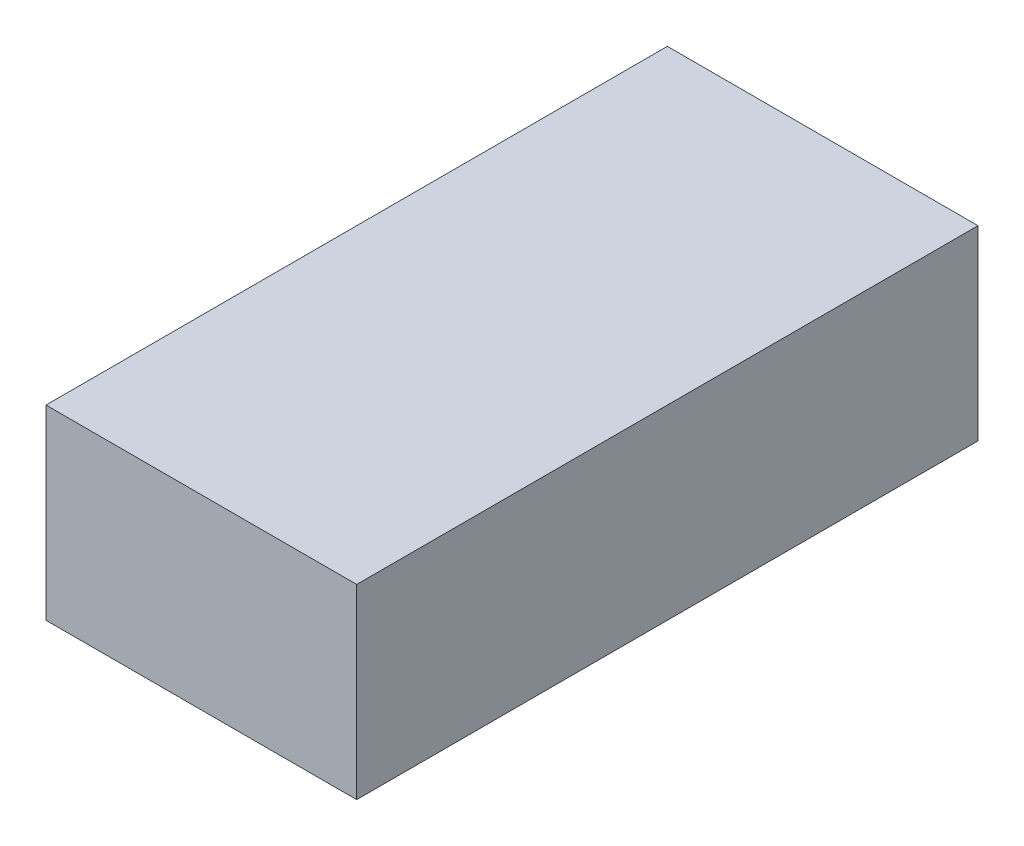
ISO-10303-21;
HEADER;
FILE_DESCRIPTION(('STEP AP214'),'2;1');
FILE_NAME('part.step','',(''),(''),'','','');
FILE_SCHEMA(('AUTOMOTIVE_DESIGN { 1 0 10303 214 1 1 1 1 }'));
ENDSEC;
DATA;
#1=APPLICATION_CONTEXT('core data for automotive mechanical design processes');
#2=APPLICATION_PROTOCOL_DEFINITION('international standard','automotive_design',2000,#1);
#3=PRODUCT_CONTEXT('',#1,'mechanical');
#4=PRODUCT('Part','Part','',(#3));
#5=PRODUCT_RELATED_PRODUCT_CATEGORY('part','',(#4));
#6=PRODUCT_DEFINITION_FORMATION('','',#4);
#7=PRODUCT_DEFINITION_CONTEXT('part definition',#1,'design');
#8=PRODUCT_DEFINITION('design','',#6,#7);
#9=PRODUCT_DEFINITION_SHAPE('','',#8);
#10=(LENGTH_UNIT() NAMED_UNIT(*) SI_UNIT(.MILLI.,.METRE.));
#11=(NAMED_UNIT(*) PLANE_ANGLE_UNIT() SI_UNIT($,.RADIAN.));
#12=(NAMED_UNIT(*) SI_UNIT($,.STERADIAN.) SOLID_ANGLE_UNIT());
#13=UNCERTAINTY_MEASURE_WITH_UNIT(LENGTH_MEASURE(1.E-05),#10,'distance_accuracy_value','');
#14=(GEOMETRIC_REPRESENTATION_CONTEXT(3) GLOBAL_UNCERTAINTY_ASSIGNED_CONTEXT((#13)) GLOBAL_UNIT_ASSIGNED_CONTEXT((#10,
#11,#12)) REPRESENTATION_CONTEXT('',''));
#15=CARTESIAN_POINT('',(0.,0.,0.));
#16=DIRECTION('',(0.,0.,1.));
#17=DIRECTION('',(1.,0.,0.));
#18=AXIS2_PLACEMENT_3D('',#15,#16,#17);
#19=CARTESIAN_POINT('',(2500.,-32.3,2272.51350251044));
#20=DIRECTION('',(0.,0.,-1.));
#21=DIRECTION('',(-1.,0.,0.));
#22=AXIS2_PLACEMENT_3D('',#19,#20,#21);
#23=PLANE('',#22);
#24=DIRECTION('',(0.,-1.,0.));
#25=VECTOR('',#24,1.);
#26=CARTESIAN_POINT('',(-2500.,-32.3,2272.51350251044));
#27=LINE('',#26,#25);
#28=CARTESIAN_POINT('',(-2500.,2967.7,2272.51350251044));
#29=VERTEX_POINT('',#28);
#30=CARTESIAN_POINT('',(-2500.,-32.3,2272.51350251044));
#31=VERTEX_POINT('',#30);
#32=EDGE_CURVE('E110',#29,#31,#27,.T.);
#33=ORIENTED_EDGE('',*,*,#32,.T.);
#34=DIRECTION('',(-1.,0.,0.));
#35=VECTOR('',#34,1.);
#36=CARTESIAN_POINT('',(2500.,-32.3,2272.51350251044));
#37=LINE('',#36,#35);
#38=CARTESIAN_POINT('',(2500.,-32.3,2272.51350251044));
#39=VERTEX_POINT('',#38);
#40=EDGE_CURVE('E12',#39,#31,#37,.T.);
#41=ORIENTED_EDGE('',*,*,#40,.F.);
#42=DIRECTION('',(0.,-1.,0.));
#43=VECTOR('',#42,1.);
#44=CARTESIAN_POINT('',(2500.,-32.3,2272.51350251044));
#45=LINE('',#44,#43);
#46=CARTESIAN_POINT('',(2500.,2967.7,2272.51350251044));
#47=VERTEX_POINT('',#46);
#48=EDGE_CURVE('E98',#47,#39,#45,.T.);
#49=ORIENTED_EDGE('',*,*,#48,.F.);
#50=DIRECTION('',(-1.,0.,0.));
#51=VECTOR('',#50,1.);
#52=CARTESIAN_POINT('',(2500.,2967.7,2272.51350251044));
#53=LINE('',#52,#51);
#54=EDGE_CURVE('E106',#47,#29,#53,.T.);
#55=ORIENTED_EDGE('',*,*,#54,.T.);
#56=EDGE_LOOP('',(#33,#41,#49,#55));
#57=FACE_BOUND('',#56,.T.);
#58=ADVANCED_FACE('F47',(#57),#23,.F.);
#59=CARTESIAN_POINT('',(2500.,-32.3,2272.51350251044));
#60=DIRECTION('',(0.,1.,0.));
#61=DIRECTION('',(0.,0.,1.));
#62=AXIS2_PLACEMENT_3D('',#59,#60,#61);
#63=PLANE('',#62);
#64=DIRECTION('',(0.,0.,-1.));
#65=VECTOR('',#64,1.);
#66=CARTESIAN_POINT('',(-2500.,-32.3,2272.51350251044));
#67=LINE('',#66,#65);
#68=CARTESIAN_POINT('',(-2500.,-32.3,-7727.48649748956));
#69=VERTEX_POINT('',#68);
#70=EDGE_CURVE('E102',#31,#69,#67,.T.);
#71=ORIENTED_EDGE('',*,*,#70,.T.);
#72=DIRECTION('',(-1.,0.,0.));
#73=VECTOR('',#72,1.);
#74=CARTESIAN_POINT('',(2500.,-32.3,-7727.48649748956));
#75=LINE('',#74,#73);
#76=CARTESIAN_POINT('',(2500.,-32.3,-7727.48649748956));
#77=VERTEX_POINT('',#76);
#78=EDGE_CURVE('E55',#77,#69,#75,.T.);
#79=ORIENTED_EDGE('',*,*,#78,.F.);
#80=DIRECTION('',(0.,0.,-1.));
#81=VECTOR('',#80,1.);
#82=CARTESIAN_POINT('',(2500.,-32.3,2272.51350251044));
#83=LINE('',#82,#81);
#84=EDGE_CURVE('E93',#39,#77,#83,.T.);
#85=ORIENTED_EDGE('',*,*,#84,.F.);
#86=ORIENTED_EDGE('',*,*,#40,.T.);
#87=EDGE_LOOP('',(#71,#79,#85,#86));
#88=FACE_BOUND('',#87,.T.);
#89=ADVANCED_FACE('F101',(#88),#63,.F.);
#90=CARTESIAN_POINT('',(2500.,-32.3,-7727.48649748956));
#91=DIRECTION('',(0.,0.,1.));
#92=DIRECTION('',(1.,0.,0.));
#93=AXIS2_PLACEMENT_3D('',#90,#91,#92);
#94=PLANE('',#93);
#95=DIRECTION('',(0.,1.,0.));
#96=VECTOR('',#95,1.);
#97=CARTESIAN_POINT('',(-2500.,-32.3,-7727.48649748956));
#98=LINE('',#97,#96);
#99=CARTESIAN_POINT('',(-2500.,2967.7,-7727.48649748956));
#100=VERTEX_POINT('',#99);
#101=EDGE_CURVE('E80',#69,#100,#98,.T.);
#102=ORIENTED_EDGE('',*,*,#101,.T.);
#103=DIRECTION('',(-1.,0.,0.));
#104=VECTOR('',#103,1.);
#105=CARTESIAN_POINT('',(2500.,2967.7,-7727.48649748956));
#106=LINE('',#105,#104);
#107=CARTESIAN_POINT('',(2500.,2967.7,-7727.48649748956));
#108=VERTEX_POINT('',#107);
#109=EDGE_CURVE('E103',#108,#100,#106,.T.);
#110=ORIENTED_EDGE('',*,*,#109,.F.);
#111=DIRECTION('',(0.,1.,0.));
#112=VECTOR('',#111,1.);
#113=CARTESIAN_POINT('',(2500.,-32.3,-7727.48649748956));
#114=LINE('',#113,#112);
#115=EDGE_CURVE('E96',#77,#108,#114,.T.);
#116=ORIENTED_EDGE('',*,*,#115,.F.);
#117=ORIENTED_EDGE('',*,*,#78,.T.);
#118=EDGE_LOOP('',(#102,#110,#116,#117));
#119=FACE_BOUND('',#118,.T.);
#120=ADVANCED_FACE('F104',(#119),#94,.F.);
#121=CARTESIAN_POINT('',(2500.,2967.7,2272.51350251044));
#122=DIRECTION('',(0.,-1.,0.));
#123=DIRECTION('',(0.,0.,-1.));
#124=AXIS2_PLACEMENT_3D('',#121,#122,#123);
#125=PLANE('',#124);
#126=DIRECTION('',(0.,0.,1.));
#127=VECTOR('',#126,1.);
#128=CARTESIAN_POINT('',(-2500.,2967.7,2272.51350251044));
#129=LINE('',#128,#127);
#130=EDGE_CURVE('E86',#100,#29,#129,.T.);
#131=ORIENTED_EDGE('',*,*,#130,.T.);
#132=ORIENTED_EDGE('',*,*,#54,.F.);
#133=DIRECTION('',(0.,0.,1.));
#134=VECTOR('',#133,1.);
#135=CARTESIAN_POINT('',(2500.,2967.7,2272.51350251044));
#136=LINE('',#135,#134);
#137=EDGE_CURVE('E63',#108,#47,#136,.T.);
#138=ORIENTED_EDGE('',*,*,#137,.F.);
#139=ORIENTED_EDGE('',*,*,#109,.T.);
#140=EDGE_LOOP('',(#131,#132,#138,#139));
#141=FACE_BOUND('',#140,.T.);
#142=ADVANCED_FACE('F117',(#141),#125,.F.);
#143=CARTESIAN_POINT('',(2500.,0.,0.));
#144=DIRECTION('',(-1.,0.,0.));
#145=DIRECTION('',(0.,0.,1.));
#146=AXIS2_PLACEMENT_3D('',#143,#144,#145);
#147=PLANE('',#146);
#148=ORIENTED_EDGE('',*,*,#48,.T.);
#149=ORIENTED_EDGE('',*,*,#84,.T.);
#150=ORIENTED_EDGE('',*,*,#115,.T.);
#151=ORIENTED_EDGE('',*,*,#137,.T.);
#152=EDGE_LOOP('',(#148,#149,#150,#151));
#153=FACE_BOUND('',#152,.T.);
#154=ADVANCED_FACE('F94',(#153),#147,.F.);
#155=CARTESIAN_POINT('',(-2500.,0.,0.));
#156=DIRECTION('',(-1.,0.,0.));
#157=DIRECTION('',(0.,0.,1.));
#158=AXIS2_PLACEMENT_3D('',#155,#156,#157);
#159=PLANE('',#158);
#160=ORIENTED_EDGE('',*,*,#32,.F.);
#161=ORIENTED_EDGE('',*,*,#130,.F.);
#162=ORIENTED_EDGE('',*,*,#101,.F.);
#163=ORIENTED_EDGE('',*,*,#70,.F.);
#164=EDGE_LOOP('',(#160,#161,#162,#163));
#165=FACE_BOUND('',#164,.T.);
#166=ADVANCED_FACE('F120',(#165),#159,.T.);
#167=CLOSED_SHELL('',(#58,#89,#120,#142,#154,#166));
#168=MANIFOLD_SOLID_BREP('B2_NOT_SHOWN',#167);
#169=CARTESIAN_POINT('',(69.,0.,0.));
#170=DIRECTION('',(0.,1.,0.));
#171=DIRECTION('',(0.,0.,1.));
#172=AXIS2_PLACEMENT_3D('',#169,#170,#171);
#173=PLANE('',#172);
#174=DIRECTION('',(-1.,0.,0.));
#175=VECTOR('',#174,1.);
#176=CARTESIAN_POINT('',(-48.6,0.,-92.6559396248703));
#177=LINE('',#176,#175);
#178=CARTESIAN_POINT('',(-48.6,0.,-92.6559396248703));
#179=VERTEX_POINT('',#178);
#180=CARTESIAN_POINT('',(-69.,0.,-92.6559396248703));
#181=VERTEX_POINT('',#180);
#182=EDGE_CURVE('E360',#179,#181,#177,.T.);
#183=ORIENTED_EDGE('',*,*,#182,.T.);
#184=DIRECTION('',(0.,0.,-1.));
#185=VECTOR('',#184,1.);
#186=CARTESIAN_POINT('',(-69.,0.,0.));
#187=LINE('',#186,#185);
#188=CARTESIAN_POINT('',(-69.,0.,-139.7));
#189=VERTEX_POINT('',#188);
#190=EDGE_CURVE('E344',#181,#189,#187,.T.);
#191=ORIENTED_EDGE('',*,*,#190,.T.);
#192=DIRECTION('',(-1.,0.,0.));
#193=VECTOR('',#192,1.);
#194=CARTESIAN_POINT('',(69.,0.,-139.7));
#195=LINE('',#194,#193);
#196=CARTESIAN_POINT('',(69.,0.,-139.7));
#197=VERTEX_POINT('',#196);
#198=EDGE_CURVE('E495',#197,#189,#195,.T.);
#199=ORIENTED_EDGE('',*,*,#198,.F.);
#200=DIRECTION('',(0.,0.,-1.));
#201=VECTOR('',#200,1.);
#202=CARTESIAN_POINT('',(69.,0.,262.79362659682));
#203=LINE('',#202,#201);
#204=CARTESIAN_POINT('',(69.,0.,-92.6559396248703));
#205=VERTEX_POINT('',#204);
#206=EDGE_CURVE('E444',#205,#197,#203,.T.);
#207=ORIENTED_EDGE('',*,*,#206,.F.);
#208=DIRECTION('',(1.,0.,0.));
#209=VECTOR('',#208,1.);
#210=CARTESIAN_POINT('',(48.6,0.,-92.6559396248703));
#211=LINE('',#210,#209);
#212=CARTESIAN_POINT('',(48.6,0.,-92.6559396248703));
#213=VERTEX_POINT('',#212);
#214=EDGE_CURVE('E397',#213,#205,#211,.T.);
#215=ORIENTED_EDGE('',*,*,#214,.F.);
#216=DIRECTION('',(0.,0.,1.));
#217=VECTOR('',#216,1.);
#218=CARTESIAN_POINT('',(48.6,0.,-28.0559396248703));
#219=LINE('',#218,#217);
#220=CARTESIAN_POINT('',(48.6,0.,-28.0559396248703));
#221=VERTEX_POINT('',#220);
#222=EDGE_CURVE('E394',#213,#221,#219,.T.);
#223=ORIENTED_EDGE('',*,*,#222,.T.);
#224=DIRECTION('',(1.,0.,0.));
#225=VECTOR('',#224,1.);
#226=CARTESIAN_POINT('',(48.6,0.,-28.0559396248703));
#227=LINE('',#226,#225);
#228=CARTESIAN_POINT('',(69.,0.,-28.0559396248703));
#229=VERTEX_POINT('',#228);
#230=EDGE_CURVE('E399',#221,#229,#227,.T.);
#231=ORIENTED_EDGE('',*,*,#230,.T.);
#232=CARTESIAN_POINT('',(69.,0.,160.34406037513));
#233=VERTEX_POINT('',#232);
#234=EDGE_CURVE('E450',#233,#229,#203,.T.);
#235=ORIENTED_EDGE('',*,*,#234,.F.);
#236=DIRECTION('',(1.,0.,0.));
#237=VECTOR('',#236,1.);
#238=CARTESIAN_POINT('',(48.6,0.,160.34406037513));
#239=LINE('',#238,#237);
#240=CARTESIAN_POINT('',(48.6,0.,160.34406037513));
#241=VERTEX_POINT('',#240);
#242=EDGE_CURVE('E410',#241,#233,#239,.T.);
#243=ORIENTED_EDGE('',*,*,#242,.F.);
#244=DIRECTION('',(0.,0.,1.));
#245=VECTOR('',#244,1.);
#246=CARTESIAN_POINT('',(48.6,0.,224.94406037513));
#247=LINE('',#246,#245);
#248=CARTESIAN_POINT('',(48.6,0.,224.94406037513));
#249=VERTEX_POINT('',#248);
#250=EDGE_CURVE('E407',#241,#249,#247,.T.);
#251=ORIENTED_EDGE('',*,*,#250,.T.);
#252=DIRECTION('',(1.,0.,0.));
#253=VECTOR('',#252,1.);
#254=CARTESIAN_POINT('',(48.6,0.,224.94406037513));
#255=LINE('',#254,#253);
#256=CARTESIAN_POINT('',(69.,0.,224.94406037513));
#257=VERTEX_POINT('',#256);
#258=EDGE_CURVE('E412',#249,#257,#255,.T.);
#259=ORIENTED_EDGE('',*,*,#258,.T.);
#260=CARTESIAN_POINT('',(69.,0.,262.79362659682));
#261=VERTEX_POINT('',#260);
#262=EDGE_CURVE('E446',#261,#257,#203,.T.);
#263=ORIENTED_EDGE('',*,*,#262,.F.);
#264=DIRECTION('',(-1.,0.,0.));
#265=VECTOR('',#264,1.);
#266=CARTESIAN_POINT('',(69.,0.,262.79362659682));
#267=LINE('',#266,#265);
#268=CARTESIAN_POINT('',(-69.,0.,262.79362659682));
#269=VERTEX_POINT('',#268);
#270=EDGE_CURVE('E497',#261,#269,#267,.T.);
#271=ORIENTED_EDGE('',*,*,#270,.T.);
#272=CARTESIAN_POINT('',(-69.,0.,224.94406037513));
#273=VERTEX_POINT('',#272);
#274=EDGE_CURVE('E358',#269,#273,#187,.T.);
#275=ORIENTED_EDGE('',*,*,#274,.T.);
#276=DIRECTION('',(-1.,0.,0.));
#277=VECTOR('',#276,1.);
#278=CARTESIAN_POINT('',(-48.6,0.,224.94406037513));
#279=LINE('',#278,#277);
#280=CARTESIAN_POINT('',(-48.6,0.,224.94406037513));
#281=VERTEX_POINT('',#280);
#282=EDGE_CURVE('E383',#281,#273,#279,.T.);
#283=ORIENTED_EDGE('',*,*,#282,.F.);
#284=DIRECTION('',(0.,0.,1.));
#285=VECTOR('',#284,1.);
#286=CARTESIAN_POINT('',(-48.6,0.,224.94406037513));
#287=LINE('',#286,#285);
#288=CARTESIAN_POINT('',(-48.6,0.,160.34406037513));
#289=VERTEX_POINT('',#288);
#290=EDGE_CURVE('E380',#289,#281,#287,.T.);
#291=ORIENTED_EDGE('',*,*,#290,.F.);
#292=DIRECTION('',(-1.,0.,0.));
#293=VECTOR('',#292,1.);
#294=CARTESIAN_POINT('',(-48.6,0.,160.34406037513));
#295=LINE('',#294,#293);
#296=CARTESIAN_POINT('',(-69.,0.,160.34406037513));
#297=VERTEX_POINT('',#296);
#298=EDGE_CURVE('E386',#289,#297,#295,.T.);
#299=ORIENTED_EDGE('',*,*,#298,.T.);
#300=CARTESIAN_POINT('',(-69.,0.,-28.0559396248702));
#301=VERTEX_POINT('',#300);
#302=EDGE_CURVE('E355',#297,#301,#187,.T.);
#303=ORIENTED_EDGE('',*,*,#302,.T.);
#304=DIRECTION('',(-1.,0.,0.));
#305=VECTOR('',#304,1.);
#306=CARTESIAN_POINT('',(-48.6,0.,-28.0559396248703));
#307=LINE('',#306,#305);
#308=CARTESIAN_POINT('',(-48.6,0.,-28.0559396248703));
#309=VERTEX_POINT('',#308);
#310=EDGE_CURVE('E367',#309,#301,#307,.T.);
#311=ORIENTED_EDGE('',*,*,#310,.F.);
#312=DIRECTION('',(0.,0.,1.));
#313=VECTOR('',#312,1.);
#314=CARTESIAN_POINT('',(-48.6,0.,-28.0559396248703));
#315=LINE('',#314,#313);
#316=EDGE_CURVE('E362',#179,#309,#315,.T.);
#317=ORIENTED_EDGE('',*,*,#316,.F.);
#318=EDGE_LOOP('',(#183,#191,#199,#207,#215,#223,#231,#235,#243,#251,#259,#263,#271,#275,#283,
#291,#299,#303,#311,#317));
#319=FACE_BOUND('',#318,.T.);
#320=ADVANCED_FACE('F171',(#319),#173,.F.);
#321=CARTESIAN_POINT('',(69.,81.9,-124.7));
#322=DIRECTION('',(0.,0.,-1.));
#323=DIRECTION('',(0.,1.,0.));
#324=AXIS2_PLACEMENT_3D('',#321,#322,#323);
#325=PLANE('',#324);
#326=DIRECTION('',(-1.,0.,0.));
#327=VECTOR('',#326,1.);
#328=CARTESIAN_POINT('',(69.,81.9,-124.7));
#329=LINE('',#328,#327);
#330=CARTESIAN_POINT('',(54.,81.9,-124.7));
#331=VERTEX_POINT('',#330);
#332=CARTESIAN_POINT('',(-54.,81.9,-124.7));
#333=VERTEX_POINT('',#332);
#334=EDGE_CURVE('E490',#331,#333,#329,.T.);
#335=ORIENTED_EDGE('',*,*,#334,.T.);
#336=DIRECTION('',(0.,-1.,0.));
#337=VECTOR('',#336,1.);
#338=CARTESIAN_POINT('',(-54.,207.498925154637,-124.7));
#339=LINE('',#338,#337);
#340=CARTESIAN_POINT('',(-54.,20.,-124.7));
#341=VERTEX_POINT('',#340);
#342=EDGE_CURVE('E427',#333,#341,#339,.T.);
#343=ORIENTED_EDGE('',*,*,#342,.T.);
#344=DIRECTION('',(-1.,0.,0.));
#345=VECTOR('',#344,1.);
#346=CARTESIAN_POINT('',(69.,20.,-124.7));
#347=LINE('',#346,#345);
#348=CARTESIAN_POINT('',(54.,20.,-124.7));
#349=VERTEX_POINT('',#348);
#350=EDGE_CURVE('E487',#349,#341,#347,.T.);
#351=ORIENTED_EDGE('',*,*,#350,.F.);
#352=DIRECTION('',(0.,-1.,0.));
#353=VECTOR('',#352,1.);
#354=CARTESIAN_POINT('',(54.,207.498925154637,-124.7));
#355=LINE('',#354,#353);
#356=EDGE_CURVE('E438',#331,#349,#355,.T.);
#357=ORIENTED_EDGE('',*,*,#356,.F.);
#358=EDGE_LOOP('',(#335,#343,#351,#357));
#359=FACE_BOUND('',#358,.T.);
#360=ADVANCED_FACE('F612',(#359),#325,.F.);
#361=CARTESIAN_POINT('',(69.,20.,-124.7));
#362=DIRECTION('',(0.,-1.,0.));
#363=DIRECTION('',(0.,0.,-1.));
#364=AXIS2_PLACEMENT_3D('',#361,#362,#363);
#365=PLANE('',#364);
#366=ORIENTED_EDGE('',*,*,#350,.T.);
#367=DIRECTION('',(0.,0.,1.));
#368=VECTOR('',#367,1.);
#369=CARTESIAN_POINT('',(-54.,20.,0.));
#370=LINE('',#369,#368);
#371=CARTESIAN_POINT('',(-54.,20.,0.));
#372=VERTEX_POINT('',#371);
#373=EDGE_CURVE('E415',#341,#372,#370,.T.);
#374=ORIENTED_EDGE('',*,*,#373,.T.);
#375=DIRECTION('',(-1.,0.,0.));
#376=VECTOR('',#375,1.);
#377=CARTESIAN_POINT('',(69.,20.,0.));
#378=LINE('',#377,#376);
#379=CARTESIAN_POINT('',(54.,20.,0.));
#380=VERTEX_POINT('',#379);
#381=EDGE_CURVE('E467',#380,#372,#378,.T.);
#382=ORIENTED_EDGE('',*,*,#381,.F.);
#383=DIRECTION('',(0.,0.,1.));
#384=VECTOR('',#383,1.);
#385=CARTESIAN_POINT('',(54.,20.,0.));
#386=LINE('',#385,#384);
#387=EDGE_CURVE('E425',#349,#380,#386,.T.);
#388=ORIENTED_EDGE('',*,*,#387,.F.);
#389=EDGE_LOOP('',(#366,#374,#382,#388));
#390=FACE_BOUND('',#389,.T.);
#391=ADVANCED_FACE('F617',(#390),#365,.F.);
#392=CARTESIAN_POINT('',(69.,20.,0.));
#393=DIRECTION('',(0.,0.,1.));
#394=DIRECTION('',(1.,0.,0.));
#395=AXIS2_PLACEMENT_3D('',#392,#393,#394);
#396=PLANE('',#395);
#397=DIRECTION('',(0.,1.,0.));
#398=VECTOR('',#397,1.);
#399=CARTESIAN_POINT('',(-69.,20.,0.));
#400=LINE('',#399,#398);
#401=CARTESIAN_POINT('',(-69.,81.9000000000001,0.));
#402=VERTEX_POINT('',#401);
#403=CARTESIAN_POINT('',(-69.,123.7,0.));
#404=VERTEX_POINT('',#403);
#405=EDGE_CURVE('E472',#402,#404,#400,.T.);
#406=ORIENTED_EDGE('',*,*,#405,.T.);
#407=DIRECTION('',(-1.,0.,0.));
#408=VECTOR('',#407,1.);
#409=CARTESIAN_POINT('',(69.,123.7,0.));
#410=LINE('',#409,#408);
#411=CARTESIAN_POINT('',(69.,123.7,0.));
#412=VERTEX_POINT('',#411);
#413=EDGE_CURVE('E519',#404,#412,#410,.F.);
#414=ORIENTED_EDGE('',*,*,#413,.T.);
#415=DIRECTION('',(0.,1.,0.));
#416=VECTOR('',#415,1.);
#417=CARTESIAN_POINT('',(69.,20.,0.));
#418=LINE('',#417,#416);
#419=CARTESIAN_POINT('',(69.,81.9000000000001,0.));
#420=VERTEX_POINT('',#419);
#421=EDGE_CURVE('E454',#420,#412,#418,.T.);
#422=ORIENTED_EDGE('',*,*,#421,.F.);
#423=DIRECTION('',(-1.,0.,0.));
#424=VECTOR('',#423,1.);
#425=CARTESIAN_POINT('',(69.,81.9000000000001,0.));
#426=LINE('',#425,#424);
#427=CARTESIAN_POINT('',(54.,81.9000000000001,0.));
#428=VERTEX_POINT('',#427);
#429=EDGE_CURVE('E433',#420,#428,#426,.T.);
#430=ORIENTED_EDGE('',*,*,#429,.T.);
#431=DIRECTION('',(0.,-1.,0.));
#432=VECTOR('',#431,1.);
#433=CARTESIAN_POINT('',(54.,207.498925154637,0.));
#434=LINE('',#433,#432);
#435=EDGE_CURVE('E435',#428,#380,#434,.T.);
#436=ORIENTED_EDGE('',*,*,#435,.T.);
#437=ORIENTED_EDGE('',*,*,#381,.T.);
#438=DIRECTION('',(0.,-1.,0.));
#439=VECTOR('',#438,1.);
#440=CARTESIAN_POINT('',(-54.,207.498925154637,0.));
#441=LINE('',#440,#439);
#442=CARTESIAN_POINT('',(-54.,81.9000000000001,0.));
#443=VERTEX_POINT('',#442);
#444=EDGE_CURVE('E422',#443,#372,#441,.T.);
#445=ORIENTED_EDGE('',*,*,#444,.F.);
#446=DIRECTION('',(1.,0.,0.));
#447=VECTOR('',#446,1.);
#448=CARTESIAN_POINT('',(-69.,81.9000000000001,0.));
#449=LINE('',#448,#447);
#450=EDGE_CURVE('E421',#402,#443,#449,.T.);
#451=ORIENTED_EDGE('',*,*,#450,.F.);
#452=EDGE_LOOP('',(#406,#414,#422,#430,#436,#437,#445,#451));
#453=FACE_BOUND('',#452,.T.);
#454=ADVANCED_FACE('F625',(#453),#396,.F.);
#455=CARTESIAN_POINT('',(69.,15.7395723137565,255.14406037513));
#456=DIRECTION('',(-1.,0.,0.));
#457=DIRECTION('',(0.,0.,1.));
#458=AXIS2_PLACEMENT_3D('',#455,#456,#457);
#459=CYLINDRICAL_SURFACE('',#458,17.5);
#460=CARTESIAN_POINT('',(69.,15.7395723137565,255.14406037513));
#461=DIRECTION('',(1.,0.,0.));
#462=DIRECTION('',(0.,0.,-1.));
#463=AXIS2_PLACEMENT_3D('',#460,#461,#462);
#464=CIRCLE('',#463,17.5);
#465=CARTESIAN_POINT('',(69.,29.1597981364929,266.375602516206));
#466=VERTEX_POINT('',#465);
#467=EDGE_CURVE('E442',#466,#261,#464,.T.);
#468=ORIENTED_EDGE('',*,*,#467,.F.);
#469=DIRECTION('',(-1.,0.,0.));
#470=VECTOR('',#469,1.);
#471=CARTESIAN_POINT('',(69.,29.1597981364929,266.375602516206));
#472=LINE('',#471,#470);
#473=CARTESIAN_POINT('',(-69.,29.1597981364929,266.375602516206));
#474=VERTEX_POINT('',#473);
#475=EDGE_CURVE('E500',#466,#474,#472,.T.);
#476=ORIENTED_EDGE('',*,*,#475,.T.);
#477=CARTESIAN_POINT('',(-69.,15.7395723137565,255.14406037513));
#478=DIRECTION('',(1.,0.,0.));
#479=DIRECTION('',(0.,0.,-1.));
#480=AXIS2_PLACEMENT_3D('',#477,#478,#479);
#481=CIRCLE('',#480,17.5);
#482=EDGE_CURVE('E356',#474,#269,#481,.T.);
#483=ORIENTED_EDGE('',*,*,#482,.T.);
#484=ORIENTED_EDGE('',*,*,#270,.F.);
#485=EDGE_LOOP('',(#468,#476,#483,#484));
#486=FACE_BOUND('',#485,.T.);
#487=ADVANCED_FACE('F567',(#486),#459,.T.);
#488=CARTESIAN_POINT('',(69.,0.,-139.7));
#489=DIRECTION('',(0.,0.,1.));
#490=DIRECTION('',(1.,0.,0.));
#491=AXIS2_PLACEMENT_3D('',#488,#489,#490);
#492=PLANE('',#491);
#493=DIRECTION('',(0.,1.,0.));
#494=VECTOR('',#493,1.);
#495=CARTESIAN_POINT('',(-69.,0.,-139.7));
#496=LINE('',#495,#494);
#497=CARTESIAN_POINT('',(-69.,81.9,-139.7));
#498=VERTEX_POINT('',#497);
#499=EDGE_CURVE('E351',#189,#498,#496,.T.);
#500=ORIENTED_EDGE('',*,*,#499,.T.);
#501=DIRECTION('',(-1.,0.,0.));
#502=VECTOR('',#501,1.);
#503=CARTESIAN_POINT('',(69.,81.9,-139.7));
#504=LINE('',#503,#502);
#505=CARTESIAN_POINT('',(69.,81.9,-139.7));
#506=VERTEX_POINT('',#505);
#507=EDGE_CURVE('E492',#506,#498,#504,.T.);
#508=ORIENTED_EDGE('',*,*,#507,.F.);
#509=DIRECTION('',(0.,1.,0.));
#510=VECTOR('',#509,1.);
#511=CARTESIAN_POINT('',(69.,0.,-139.7));
#512=LINE('',#511,#510);
#513=EDGE_CURVE('E449',#197,#506,#512,.T.);
#514=ORIENTED_EDGE('',*,*,#513,.F.);
#515=ORIENTED_EDGE('',*,*,#198,.T.);
#516=EDGE_LOOP('',(#500,#508,#514,#515));
#517=FACE_BOUND('',#516,.T.);
#518=ADVANCED_FACE('F584',(#517),#492,.F.);
#519=CARTESIAN_POINT('',(69.,81.9,-139.7));
#520=DIRECTION('',(0.,-1.,0.));
#521=DIRECTION('',(0.,0.,-1.));
#522=AXIS2_PLACEMENT_3D('',#519,#520,#521);
#523=PLANE('',#522);
#524=DIRECTION('',(0.,0.,1.));
#525=VECTOR('',#524,1.);
#526=CARTESIAN_POINT('',(-69.,81.9,-139.7));
#527=LINE('',#526,#525);
#528=EDGE_CURVE('E470',#498,#402,#527,.T.);
#529=ORIENTED_EDGE('',*,*,#528,.T.);
#530=ORIENTED_EDGE('',*,*,#450,.T.);
#531=DIRECTION('',(0.,0.,-1.));
#532=VECTOR('',#531,1.);
#533=CARTESIAN_POINT('',(-54.,81.9000000000001,1.40315921572861E-13));
#534=LINE('',#533,#532);
#535=EDGE_CURVE('E418',#443,#333,#534,.T.);
#536=ORIENTED_EDGE('',*,*,#535,.T.);
#537=ORIENTED_EDGE('',*,*,#334,.F.);
#538=DIRECTION('',(0.,0.,-1.));
#539=VECTOR('',#538,1.);
#540=CARTESIAN_POINT('',(54.,81.9000000000001,1.40315921572861E-13));
#541=LINE('',#540,#539);
#542=EDGE_CURVE('E431',#428,#331,#541,.T.);
#543=ORIENTED_EDGE('',*,*,#542,.F.);
#544=ORIENTED_EDGE('',*,*,#429,.F.);
#545=DIRECTION('',(0.,0.,1.));
#546=VECTOR('',#545,1.);
#547=CARTESIAN_POINT('',(69.,81.9,-139.7));
#548=LINE('',#547,#546);
#549=EDGE_CURVE('E452',#506,#420,#548,.T.);
#550=ORIENTED_EDGE('',*,*,#549,.F.);
#551=ORIENTED_EDGE('',*,*,#507,.T.);
#552=EDGE_LOOP('',(#529,#530,#536,#537,#543,#544,#550,#551));
#553=FACE_BOUND('',#552,.T.);
#554=ADVANCED_FACE('F588',(#553),#523,.F.);
#555=CARTESIAN_POINT('',(69.,133.7,0.));
#556=DIRECTION('',(0.,-1.,0.));
#557=DIRECTION('',(0.,0.,-1.));
#558=AXIS2_PLACEMENT_3D('',#555,#556,#557);
#559=PLANE('',#558);
#560=DIRECTION('',(0.,0.,1.));
#561=VECTOR('',#560,1.);
#562=CARTESIAN_POINT('',(69.,133.7,0.));
#563=LINE('',#562,#561);
#564=CARTESIAN_POINT('',(69.,133.7,10.));
#565=VERTEX_POINT('',#564);
#566=CARTESIAN_POINT('',(69.,133.7,111.84701211121));
#567=VERTEX_POINT('',#566);
#568=EDGE_CURVE('E457',#565,#567,#563,.T.);
#569=ORIENTED_EDGE('',*,*,#568,.F.);
#570=DIRECTION('',(-1.,0.,0.));
#571=VECTOR('',#570,1.);
#572=CARTESIAN_POINT('',(69.,133.7,10.));
#573=LINE('',#572,#571);
#574=CARTESIAN_POINT('',(-69.,133.7,10.));
#575=VERTEX_POINT('',#574);
#576=EDGE_CURVE('E510',#565,#575,#573,.T.);
#577=ORIENTED_EDGE('',*,*,#576,.T.);
#578=DIRECTION('',(0.,0.,1.));
#579=VECTOR('',#578,1.);
#580=CARTESIAN_POINT('',(-69.,133.7,0.));
#581=LINE('',#580,#579);
#582=CARTESIAN_POINT('',(-69.,133.7,111.84701211121));
#583=VERTEX_POINT('',#582);
#584=EDGE_CURVE('E475',#575,#583,#581,.T.);
#585=ORIENTED_EDGE('',*,*,#584,.T.);
#586=DIRECTION('',(-1.,0.,0.));
#587=VECTOR('',#586,1.);
#588=CARTESIAN_POINT('',(69.,133.7,111.84701211121));
#589=LINE('',#588,#587);
#590=EDGE_CURVE('E508',#583,#567,#589,.F.);
#591=ORIENTED_EDGE('',*,*,#590,.T.);
#592=EDGE_LOOP('',(#569,#577,#585,#591));
#593=FACE_BOUND('',#592,.T.);
#594=ADVANCED_FACE('F598',(#593),#559,.F.);
#595=CARTESIAN_POINT('',(69.,133.7,115.));
#596=DIRECTION('',(0.,-0.819152044288995,-0.573576436351042));
#597=DIRECTION('',(0.,0.573576436351042,-0.819152044288995));
#598=AXIS2_PLACEMENT_3D('',#595,#596,#597);
#599=PLANE('',#598);
#600=DIRECTION('',(0.,-0.573576436351042,0.819152044288994));
#601=VECTOR('',#600,1.);
#602=CARTESIAN_POINT('',(69.,133.7,115.));
#603=LINE('',#602,#601);
#604=CARTESIAN_POINT('',(69.,131.89152044289,117.582776474721));
#605=VERTEX_POINT('',#604);
#606=CARTESIAN_POINT('',(69.,95.7296916570861,169.227220175317));
#607=VERTEX_POINT('',#606);
#608=EDGE_CURVE('E460',#605,#607,#603,.T.);
#609=ORIENTED_EDGE('',*,*,#608,.F.);
#610=DIRECTION('',(-1.,0.,0.));
#611=VECTOR('',#610,1.);
#612=CARTESIAN_POINT('',(69.,131.89152044289,117.582776474721));
#613=LINE('',#612,#611);
#614=CARTESIAN_POINT('',(-69.,131.89152044289,117.582776474721));
#615=VERTEX_POINT('',#614);
#616=EDGE_CURVE('E529',#605,#615,#613,.T.);
#617=ORIENTED_EDGE('',*,*,#616,.T.);
#618=DIRECTION('',(0.,-0.573576436351042,0.819152044288994));
#619=VECTOR('',#618,1.);
#620=CARTESIAN_POINT('',(-69.,133.7,115.));
#621=LINE('',#620,#619);
#622=CARTESIAN_POINT('',(-69.,95.7296916570861,169.227220175317));
#623=VERTEX_POINT('',#622);
#624=EDGE_CURVE('E478',#615,#623,#621,.T.);
#625=ORIENTED_EDGE('',*,*,#624,.T.);
#626=DIRECTION('',(-1.,0.,0.));
#627=VECTOR('',#626,1.);
#628=CARTESIAN_POINT('',(69.,95.7296916570861,169.227220175317));
#629=LINE('',#628,#627);
#630=EDGE_CURVE('E527',#623,#607,#629,.F.);
#631=ORIENTED_EDGE('',*,*,#630,.T.);
#632=EDGE_LOOP('',(#609,#617,#625,#631));
#633=FACE_BOUND('',#632,.T.);
#634=ADVANCED_FACE('F546',(#633),#599,.F.);
#635=CARTESIAN_POINT('',(69.,94.3526564663185,171.193830238225));
#636=DIRECTION('',(0.,-0.990268068741571,-0.139173100960059));
#637=DIRECTION('',(0.,0.139173100960059,-0.990268068741571));
#638=AXIS2_PLACEMENT_3D('',#635,#636,#637);
#639=PLANE('',#638);
#640=DIRECTION('',(0.,-0.139173100960059,0.990268068741571));
#641=VECTOR('',#640,1.);
#642=CARTESIAN_POINT('',(69.,94.3526564663185,171.193830238225));
#643=LINE('',#642,#641);
#644=CARTESIAN_POINT('',(69.,94.0185314125603,173.571253529226));
#645=VERTEX_POINT('',#644);
#646=CARTESIAN_POINT('',(69.,82.6889579367665,254.185357606421));
#647=VERTEX_POINT('',#646);
#648=EDGE_CURVE('E462',#645,#647,#643,.T.);
#649=ORIENTED_EDGE('',*,*,#648,.F.);
#650=DIRECTION('',(-1.,0.,0.));
#651=VECTOR('',#650,1.);
#652=CARTESIAN_POINT('',(-69.,94.0185314125603,173.571253529226));
#653=LINE('',#652,#651);
#654=CARTESIAN_POINT('',(-69.,94.0185314125603,173.571253529226));
#655=VERTEX_POINT('',#654);
#656=EDGE_CURVE('E533',#645,#655,#653,.T.);
#657=ORIENTED_EDGE('',*,*,#656,.T.);
#658=DIRECTION('',(0.,-0.139173100960059,0.990268068741571));
#659=VECTOR('',#658,1.);
#660=CARTESIAN_POINT('',(-69.,94.3526564663185,171.193830238225));
#661=LINE('',#660,#659);
#662=CARTESIAN_POINT('',(-69.,82.6889579367665,254.185357606421));
#663=VERTEX_POINT('',#662);
#664=EDGE_CURVE('E481',#655,#663,#661,.T.);
#665=ORIENTED_EDGE('',*,*,#664,.T.);
#666=DIRECTION('',(-1.,0.,0.));
#667=VECTOR('',#666,1.);
#668=CARTESIAN_POINT('',(69.,82.6889579367665,254.185357606421));
#669=LINE('',#668,#667);
#670=EDGE_CURVE('E186',#663,#647,#669,.F.);
#671=ORIENTED_EDGE('',*,*,#670,.T.);
#672=EDGE_LOOP('',(#649,#657,#665,#671));
#673=FACE_BOUND('',#672,.T.);
#674=ADVANCED_FACE('F549',(#673),#639,.F.);
#675=CARTESIAN_POINT('',(69.,81.4791446275131,262.79362659682));
#676=DIRECTION('',(0.,0.,-1.));
#677=DIRECTION('',(0.,1.,0.));
#678=AXIS2_PLACEMENT_3D('',#675,#676,#677);
#679=PLANE('',#678);
#680=DIRECTION('',(0.,-1.,0.));
#681=VECTOR('',#680,1.);
#682=CARTESIAN_POINT('',(-69.,81.4791446275131,262.79362659682));
#683=LINE('',#682,#681);
#684=CARTESIAN_POINT('',(-69.,72.7862772493507,262.79362659682));
#685=VERTEX_POINT('',#684);
#686=CARTESIAN_POINT('',(-69.,36.8284986066279,262.79362659682));
#687=VERTEX_POINT('',#686);
#688=EDGE_CURVE('E445',#685,#687,#683,.T.);
#689=ORIENTED_EDGE('',*,*,#688,.T.);
#690=DIRECTION('',(1.,0.,0.));
#691=VECTOR('',#690,1.);
#692=CARTESIAN_POINT('',(69.,36.8284986066279,262.79362659682));
#693=LINE('',#692,#691);
#694=CARTESIAN_POINT('',(69.,36.8284986066279,262.79362659682));
#695=VERTEX_POINT('',#694);
#696=EDGE_CURVE('E506',#687,#695,#693,.T.);
#697=ORIENTED_EDGE('',*,*,#696,.T.);
#698=DIRECTION('',(0.,-1.,0.));
#699=VECTOR('',#698,1.);
#700=CARTESIAN_POINT('',(69.,81.4791446275131,262.79362659682));
#701=LINE('',#700,#699);
#702=CARTESIAN_POINT('',(69.,72.7862772493507,262.79362659682));
#703=VERTEX_POINT('',#702);
#704=EDGE_CURVE('E464',#703,#695,#701,.T.);
#705=ORIENTED_EDGE('',*,*,#704,.F.);
#706=DIRECTION('',(-1.,0.,0.));
#707=VECTOR('',#706,1.);
#708=CARTESIAN_POINT('',(69.,72.7862772493507,262.79362659682));
#709=LINE('',#708,#707);
#710=EDGE_CURVE('E503',#703,#685,#709,.T.);
#711=ORIENTED_EDGE('',*,*,#710,.T.);
#712=EDGE_LOOP('',(#689,#697,#705,#711));
#713=FACE_BOUND('',#712,.T.);
#714=ADVANCED_FACE('F557',(#713),#679,.F.);
#715=CARTESIAN_POINT('',(69.,15.7395723137565,255.14406037513));
#716=DIRECTION('',(1.,0.,0.));
#717=DIRECTION('',(0.,0.,-1.));
#718=AXIS2_PLACEMENT_3D('',#715,#716,#717);
#719=PLANE('',#718);
#720=ORIENTED_EDGE('',*,*,#421,.T.);
#721=CARTESIAN_POINT('',(69.,123.7,10.));
#722=DIRECTION('',(1.,0.,0.));
#723=DIRECTION('',(0.,0.,-1.));
#724=AXIS2_PLACEMENT_3D('',#721,#722,#723);
#725=CIRCLE('',#724,10.);
#726=EDGE_CURVE('E525',#412,#565,#725,.T.);
#727=ORIENTED_EDGE('',*,*,#726,.T.);
#728=ORIENTED_EDGE('',*,*,#568,.T.);
#729=CARTESIAN_POINT('',(69.,123.7,111.84701211121));
#730=DIRECTION('',(1.,0.,0.));
#731=DIRECTION('',(0.,0.,-1.));
#732=AXIS2_PLACEMENT_3D('',#729,#730,#731);
#733=CIRCLE('',#732,10.);
#734=EDGE_CURVE('E523',#567,#605,#733,.T.);
#735=ORIENTED_EDGE('',*,*,#734,.T.);
#736=ORIENTED_EDGE('',*,*,#608,.T.);
#737=CARTESIAN_POINT('',(69.,103.921212099976,174.962984538827));
#738=DIRECTION('',(1.,0.,0.));
#739=DIRECTION('',(0.,0.,-1.));
#740=AXIS2_PLACEMENT_3D('',#737,#738,#739);
#741=CIRCLE('',#740,10.);
#742=EDGE_CURVE('E45',#607,#645,#741,.F.);
#743=ORIENTED_EDGE('',*,*,#742,.T.);
#744=ORIENTED_EDGE('',*,*,#648,.T.);
#745=CARTESIAN_POINT('',(69.,72.7862772493507,252.79362659682));
#746=DIRECTION('',(1.,0.,0.));
#747=DIRECTION('',(0.,0.,-1.));
#748=AXIS2_PLACEMENT_3D('',#745,#746,#747);
#749=CIRCLE('',#748,10.);
#750=EDGE_CURVE('E521',#647,#703,#749,.T.);
#751=ORIENTED_EDGE('',*,*,#750,.T.);
#752=ORIENTED_EDGE('',*,*,#704,.T.);
#753=CARTESIAN_POINT('',(69.,36.8284986066279,272.79362659682));
#754=DIRECTION('',(1.,0.,0.));
#755=DIRECTION('',(0.,0.,-1.));
#756=AXIS2_PLACEMENT_3D('',#753,#754,#755);
#757=CIRCLE('',#756,10.);
#758=EDGE_CURVE('E538',#695,#466,#757,.F.);
#759=ORIENTED_EDGE('',*,*,#758,.T.);
#760=ORIENTED_EDGE('',*,*,#467,.T.);
#761=ORIENTED_EDGE('',*,*,#262,.T.);
#762=CARTESIAN_POINT('',(69.,0.,192.64406037513));
#763=DIRECTION('',(1.,0.,0.));
#764=DIRECTION('',(0.,0.,-1.));
#765=AXIS2_PLACEMENT_3D('',#762,#763,#764);
#766=CIRCLE('',#765,32.3);
#767=EDGE_CURVE('E402',#257,#233,#766,.T.);
#768=ORIENTED_EDGE('',*,*,#767,.T.);
#769=ORIENTED_EDGE('',*,*,#234,.T.);
#770=CARTESIAN_POINT('',(69.,0.,-60.3559396248703));
#771=DIRECTION('',(1.,0.,0.));
#772=DIRECTION('',(0.,0.,-1.));
#773=AXIS2_PLACEMENT_3D('',#770,#771,#772);
#774=CIRCLE('',#773,32.3);
#775=EDGE_CURVE('E389',#229,#205,#774,.T.);
#776=ORIENTED_EDGE('',*,*,#775,.T.);
#777=ORIENTED_EDGE('',*,*,#206,.T.);
#778=ORIENTED_EDGE('',*,*,#513,.T.);
#779=ORIENTED_EDGE('',*,*,#549,.T.);
#780=EDGE_LOOP('',(#720,#727,#728,#735,#736,#743,#744,#751,#752,#759,#760,#761,#768,#769,#776,
#777,#778,#779));
#781=FACE_BOUND('',#780,.T.);
#782=ADVANCED_FACE('F551',(#781),#719,.T.);
#783=CARTESIAN_POINT('',(-69.,15.7395723137565,255.14406037513));
#784=DIRECTION('',(1.,0.,0.));
#785=DIRECTION('',(0.,0.,-1.));
#786=AXIS2_PLACEMENT_3D('',#783,#784,#785);
#787=PLANE('',#786);
#788=ORIENTED_EDGE('',*,*,#584,.F.);
#789=CARTESIAN_POINT('',(-69.,123.7,10.));
#790=DIRECTION('',(1.,0.,0.));
#791=DIRECTION('',(0.,0.,-1.));
#792=AXIS2_PLACEMENT_3D('',#789,#790,#791);
#793=CIRCLE('',#792,10.);
#794=EDGE_CURVE('E517',#575,#404,#793,.F.);
#795=ORIENTED_EDGE('',*,*,#794,.T.);
#796=ORIENTED_EDGE('',*,*,#405,.F.);
#797=ORIENTED_EDGE('',*,*,#528,.F.);
#798=ORIENTED_EDGE('',*,*,#499,.F.);
#799=ORIENTED_EDGE('',*,*,#190,.F.);
#800=CARTESIAN_POINT('',(-69.,0.,-60.3559396248703));
#801=DIRECTION('',(1.,0.,0.));
#802=DIRECTION('',(0.,0.,-1.));
#803=AXIS2_PLACEMENT_3D('',#800,#801,#802);
#804=CIRCLE('',#803,32.3);
#805=EDGE_CURVE('E349',#301,#181,#804,.T.);
#806=ORIENTED_EDGE('',*,*,#805,.F.);
#807=ORIENTED_EDGE('',*,*,#302,.F.);
#808=CARTESIAN_POINT('',(-69.,0.,192.64406037513));
#809=DIRECTION('',(1.,0.,0.));
#810=DIRECTION('',(0.,0.,-1.));
#811=AXIS2_PLACEMENT_3D('',#808,#809,#810);
#812=CIRCLE('',#811,32.3);
#813=EDGE_CURVE('E366',#273,#297,#812,.T.);
#814=ORIENTED_EDGE('',*,*,#813,.F.);
#815=ORIENTED_EDGE('',*,*,#274,.F.);
#816=ORIENTED_EDGE('',*,*,#482,.F.);
#817=CARTESIAN_POINT('',(-69.,36.8284986066279,272.79362659682));
#818=DIRECTION('',(1.,0.,0.));
#819=DIRECTION('',(0.,0.,-1.));
#820=AXIS2_PLACEMENT_3D('',#817,#818,#819);
#821=CIRCLE('',#820,10.);
#822=EDGE_CURVE('E536',#474,#687,#821,.T.);
#823=ORIENTED_EDGE('',*,*,#822,.T.);
#824=ORIENTED_EDGE('',*,*,#688,.F.);
#825=CARTESIAN_POINT('',(-69.,72.7862772493507,252.79362659682));
#826=DIRECTION('',(1.,0.,0.));
#827=DIRECTION('',(0.,0.,-1.));
#828=AXIS2_PLACEMENT_3D('',#825,#826,#827);
#829=CIRCLE('',#828,10.);
#830=EDGE_CURVE('E513',#685,#663,#829,.F.);
#831=ORIENTED_EDGE('',*,*,#830,.T.);
#832=ORIENTED_EDGE('',*,*,#664,.F.);
#833=CARTESIAN_POINT('',(-69.,103.921212099976,174.962984538827));
#834=DIRECTION('',(1.,0.,0.));
#835=DIRECTION('',(0.,0.,-1.));
#836=AXIS2_PLACEMENT_3D('',#833,#834,#835);
#837=CIRCLE('',#836,10.);
#838=EDGE_CURVE('E179',#655,#623,#837,.T.);
#839=ORIENTED_EDGE('',*,*,#838,.T.);
#840=ORIENTED_EDGE('',*,*,#624,.F.);
#841=CARTESIAN_POINT('',(-69.,123.7,111.84701211121));
#842=DIRECTION('',(1.,0.,0.));
#843=DIRECTION('',(0.,0.,-1.));
#844=AXIS2_PLACEMENT_3D('',#841,#842,#843);
#845=CIRCLE('',#844,10.);
#846=EDGE_CURVE('E515',#615,#583,#845,.F.);
#847=ORIENTED_EDGE('',*,*,#846,.T.);
#848=EDGE_LOOP('',(#788,#795,#796,#797,#798,#799,#806,#807,#814,#815,#816,#823,#824,#831,#832,
#839,#840,#847));
#849=FACE_BOUND('',#848,.T.);
#850=ADVANCED_FACE('F347',(#849),#787,.F.);
#851=CARTESIAN_POINT('',(54.,207.498925154637,0.));
#852=DIRECTION('',(1.,0.,0.));
#853=DIRECTION('',(0.,0.,-1.));
#854=AXIS2_PLACEMENT_3D('',#851,#852,#853);
#855=PLANE('',#854);
#856=ORIENTED_EDGE('',*,*,#435,.F.);
#857=ORIENTED_EDGE('',*,*,#542,.T.);
#858=ORIENTED_EDGE('',*,*,#356,.T.);
#859=ORIENTED_EDGE('',*,*,#387,.T.);
#860=EDGE_LOOP('',(#856,#857,#858,#859));
#861=FACE_BOUND('',#860,.T.);
#862=ADVANCED_FACE('F661',(#861),#855,.F.);
#863=CARTESIAN_POINT('',(-54.,207.498925154637,0.));
#864=DIRECTION('',(1.,0.,0.));
#865=DIRECTION('',(0.,0.,-1.));
#866=AXIS2_PLACEMENT_3D('',#863,#864,#865);
#867=PLANE('',#866);
#868=ORIENTED_EDGE('',*,*,#535,.F.);
#869=ORIENTED_EDGE('',*,*,#444,.T.);
#870=ORIENTED_EDGE('',*,*,#373,.F.);
#871=ORIENTED_EDGE('',*,*,#342,.F.);
#872=EDGE_LOOP('',(#868,#869,#870,#871));
#873=FACE_BOUND('',#872,.T.);
#874=ADVANCED_FACE('F658',(#873),#867,.T.);
#875=CARTESIAN_POINT('',(48.6,0.,192.64406037513));
#876=DIRECTION('',(1.,0.,0.));
#877=DIRECTION('',(0.,0.,-1.));
#878=AXIS2_PLACEMENT_3D('',#875,#876,#877);
#879=CYLINDRICAL_SURFACE('',#878,32.3);
#880=ORIENTED_EDGE('',*,*,#767,.F.);
#881=ORIENTED_EDGE('',*,*,#258,.F.);
#882=CARTESIAN_POINT('',(48.6,0.,192.64406037513));
#883=DIRECTION('',(1.,0.,0.));
#884=DIRECTION('',(0.,0.,-1.));
#885=AXIS2_PLACEMENT_3D('',#882,#883,#884);
#886=CIRCLE('',#885,32.3);
#887=EDGE_CURVE('E405',#249,#241,#886,.T.);
#888=ORIENTED_EDGE('',*,*,#887,.T.);
#889=ORIENTED_EDGE('',*,*,#242,.T.);
#890=EDGE_LOOP('',(#880,#881,#888,#889));
#891=FACE_BOUND('',#890,.T.);
#892=ADVANCED_FACE('F574',(#891),#879,.T.);
#893=CARTESIAN_POINT('',(48.6,0.,192.64406037513));
#894=DIRECTION('',(1.,0.,0.));
#895=DIRECTION('',(0.,0.,-1.));
#896=AXIS2_PLACEMENT_3D('',#893,#894,#895);
#897=PLANE('',#896);
#898=ORIENTED_EDGE('',*,*,#887,.F.);
#899=ORIENTED_EDGE('',*,*,#250,.F.);
#900=EDGE_LOOP('',(#898,#899));
#901=FACE_BOUND('',#900,.T.);
#902=ADVANCED_FACE('F576',(#901),#897,.F.);
#903=CARTESIAN_POINT('',(48.6,0.,-60.3559396248703));
#904=DIRECTION('',(1.,0.,0.));
#905=DIRECTION('',(0.,0.,-1.));
#906=AXIS2_PLACEMENT_3D('',#903,#904,#905);
#907=CYLINDRICAL_SURFACE('',#906,32.3);
#908=ORIENTED_EDGE('',*,*,#775,.F.);
#909=ORIENTED_EDGE('',*,*,#230,.F.);
#910=CARTESIAN_POINT('',(48.6,0.,-60.3559396248703));
#911=DIRECTION('',(1.,0.,0.));
#912=DIRECTION('',(0.,0.,-1.));
#913=AXIS2_PLACEMENT_3D('',#910,#911,#912);
#914=CIRCLE('',#913,32.3);
#915=EDGE_CURVE('E392',#221,#213,#914,.T.);
#916=ORIENTED_EDGE('',*,*,#915,.T.);
#917=ORIENTED_EDGE('',*,*,#214,.T.);
#918=EDGE_LOOP('',(#908,#909,#916,#917));
#919=FACE_BOUND('',#918,.T.);
#920=ADVANCED_FACE('F649',(#919),#907,.T.);
#921=CARTESIAN_POINT('',(48.6,0.,-60.3559396248703));
#922=DIRECTION('',(1.,0.,0.));
#923=DIRECTION('',(0.,0.,-1.));
#924=AXIS2_PLACEMENT_3D('',#921,#922,#923);
#925=PLANE('',#924);
#926=ORIENTED_EDGE('',*,*,#915,.F.);
#927=ORIENTED_EDGE('',*,*,#222,.F.);
#928=EDGE_LOOP('',(#926,#927));
#929=FACE_BOUND('',#928,.T.);
#930=ADVANCED_FACE('F645',(#929),#925,.F.);
#931=CARTESIAN_POINT('',(-48.6,0.,192.64406037513));
#932=DIRECTION('',(-1.,0.,0.));
#933=DIRECTION('',(0.,0.,1.));
#934=AXIS2_PLACEMENT_3D('',#931,#932,#933);
#935=CYLINDRICAL_SURFACE('',#934,32.3);
#936=ORIENTED_EDGE('',*,*,#813,.T.);
#937=ORIENTED_EDGE('',*,*,#298,.F.);
#938=CARTESIAN_POINT('',(-48.6,0.,192.64406037513));
#939=DIRECTION('',(1.,0.,0.));
#940=DIRECTION('',(0.,0.,-1.));
#941=AXIS2_PLACEMENT_3D('',#938,#939,#940);
#942=CIRCLE('',#941,32.3);
#943=EDGE_CURVE('E377',#281,#289,#942,.T.);
#944=ORIENTED_EDGE('',*,*,#943,.F.);
#945=ORIENTED_EDGE('',*,*,#282,.T.);
#946=EDGE_LOOP('',(#936,#937,#944,#945));
#947=FACE_BOUND('',#946,.T.);
#948=ADVANCED_FACE('F641',(#947),#935,.T.);
#949=CARTESIAN_POINT('',(-48.6,0.,192.64406037513));
#950=DIRECTION('',(-1.,0.,0.));
#951=DIRECTION('',(0.,0.,-1.));
#952=AXIS2_PLACEMENT_3D('',#949,#950,#951);
#953=PLANE('',#952);
#954=ORIENTED_EDGE('',*,*,#943,.T.);
#955=ORIENTED_EDGE('',*,*,#290,.T.);
#956=EDGE_LOOP('',(#954,#955));
#957=FACE_BOUND('',#956,.T.);
#958=ADVANCED_FACE('F636',(#957),#953,.F.);
#959=CARTESIAN_POINT('',(-48.6,0.,-60.3559396248703));
#960=DIRECTION('',(-1.,0.,0.));
#961=DIRECTION('',(0.,0.,1.));
#962=AXIS2_PLACEMENT_3D('',#959,#960,#961);
#963=CYLINDRICAL_SURFACE('',#962,32.3);
#964=ORIENTED_EDGE('',*,*,#805,.T.);
#965=ORIENTED_EDGE('',*,*,#182,.F.);
#966=CARTESIAN_POINT('',(-48.6,0.,-60.3559396248703));
#967=DIRECTION('',(1.,0.,0.));
#968=DIRECTION('',(0.,0.,-1.));
#969=AXIS2_PLACEMENT_3D('',#966,#967,#968);
#970=CIRCLE('',#969,32.3);
#971=EDGE_CURVE('E371',#309,#179,#970,.T.);
#972=ORIENTED_EDGE('',*,*,#971,.F.);
#973=ORIENTED_EDGE('',*,*,#310,.T.);
#974=EDGE_LOOP('',(#964,#965,#972,#973));
#975=FACE_BOUND('',#974,.T.);
#976=ADVANCED_FACE('F370',(#975),#963,.T.);
#977=CARTESIAN_POINT('',(-48.6,0.,-60.3559396248703));
#978=DIRECTION('',(-1.,0.,0.));
#979=DIRECTION('',(0.,0.,-1.));
#980=AXIS2_PLACEMENT_3D('',#977,#978,#979);
#981=PLANE('',#980);
#982=ORIENTED_EDGE('',*,*,#971,.T.);
#983=ORIENTED_EDGE('',*,*,#316,.T.);
#984=EDGE_LOOP('',(#982,#983));
#985=FACE_BOUND('',#984,.T.);
#986=ADVANCED_FACE('F627',(#985),#981,.F.);
#987=CARTESIAN_POINT('',(69.,36.8284986066279,272.79362659682));
#988=DIRECTION('',(-1.,0.,0.));
#989=DIRECTION('',(0.,0.,1.));
#990=AXIS2_PLACEMENT_3D('',#987,#988,#989);
#991=CYLINDRICAL_SURFACE('',#990,10.);
#992=ORIENTED_EDGE('',*,*,#758,.F.);
#993=ORIENTED_EDGE('',*,*,#696,.F.);
#994=ORIENTED_EDGE('',*,*,#822,.F.);
#995=ORIENTED_EDGE('',*,*,#475,.F.);
#996=EDGE_LOOP('',(#992,#993,#994,#995));
#997=FACE_BOUND('',#996,.T.);
#998=ADVANCED_FACE('F564',(#997),#991,.F.);
#999=CARTESIAN_POINT('',(69.,123.7,10.));
#1000=DIRECTION('',(-1.,0.,0.));
#1001=DIRECTION('',(0.,0.,1.));
#1002=AXIS2_PLACEMENT_3D('',#999,#1000,#1001);
#1003=CYLINDRICAL_SURFACE('',#1002,10.);
#1004=ORIENTED_EDGE('',*,*,#726,.F.);
#1005=ORIENTED_EDGE('',*,*,#413,.F.);
#1006=ORIENTED_EDGE('',*,*,#794,.F.);
#1007=ORIENTED_EDGE('',*,*,#576,.F.);
#1008=EDGE_LOOP('',(#1004,#1005,#1006,#1007));
#1009=FACE_BOUND('',#1008,.T.);
#1010=ADVANCED_FACE('F596',(#1009),#1003,.T.);
#1011=CARTESIAN_POINT('',(69.,123.7,111.84701211121));
#1012=DIRECTION('',(-1.,0.,0.));
#1013=DIRECTION('',(0.,0.,1.));
#1014=AXIS2_PLACEMENT_3D('',#1011,#1012,#1013);
#1015=CYLINDRICAL_SURFACE('',#1014,10.);
#1016=ORIENTED_EDGE('',*,*,#734,.F.);
#1017=ORIENTED_EDGE('',*,*,#590,.F.);
#1018=ORIENTED_EDGE('',*,*,#846,.F.);
#1019=ORIENTED_EDGE('',*,*,#616,.F.);
#1020=EDGE_LOOP('',(#1016,#1017,#1018,#1019));
#1021=FACE_BOUND('',#1020,.T.);
#1022=ADVANCED_FACE('F603',(#1021),#1015,.T.);
#1023=CARTESIAN_POINT('',(69.,103.921212099976,174.962984538827));
#1024=DIRECTION('',(1.,0.,0.));
#1025=DIRECTION('',(0.,0.,-1.));
#1026=AXIS2_PLACEMENT_3D('',#1023,#1024,#1025);
#1027=CYLINDRICAL_SURFACE('',#1026,10.);
#1028=ORIENTED_EDGE('',*,*,#742,.F.);
#1029=ORIENTED_EDGE('',*,*,#630,.F.);
#1030=ORIENTED_EDGE('',*,*,#838,.F.);
#1031=ORIENTED_EDGE('',*,*,#656,.F.);
#1032=EDGE_LOOP('',(#1028,#1029,#1030,#1031));
#1033=FACE_BOUND('',#1032,.T.);
#1034=ADVANCED_FACE('F548',(#1033),#1027,.F.);
#1035=CARTESIAN_POINT('',(69.,72.7862772493507,252.79362659682));
#1036=DIRECTION('',(-1.,0.,0.));
#1037=DIRECTION('',(0.,0.,1.));
#1038=AXIS2_PLACEMENT_3D('',#1035,#1036,#1037);
#1039=CYLINDRICAL_SURFACE('',#1038,10.);
#1040=ORIENTED_EDGE('',*,*,#750,.F.);
#1041=ORIENTED_EDGE('',*,*,#670,.F.);
#1042=ORIENTED_EDGE('',*,*,#830,.F.);
#1043=ORIENTED_EDGE('',*,*,#710,.F.);
#1044=EDGE_LOOP('',(#1040,#1041,#1042,#1043));
#1045=FACE_BOUND('',#1044,.T.);
#1046=ADVANCED_FACE('F173',(#1045),#1039,.T.);
#1047=CLOSED_SHELL('',(#320,#360,#391,#454,#487,#518,#554,#594,#634,#674,#714,#782,#850,#862,
#874,#892,#902,#920,#930,#948,#958,#976,#986,#998,#1010,#1022,#1034,#1046));
#1048=MANIFOLD_SOLID_BREP('B6',#1047);
#1049=ADVANCED_BREP_SHAPE_REPRESENTATION('',(#18,#168,#1048),#14);
#1050=SHAPE_DEFINITION_REPRESENTATION(#9,#1049);
ENDSEC;
END-ISO-10303-21;
